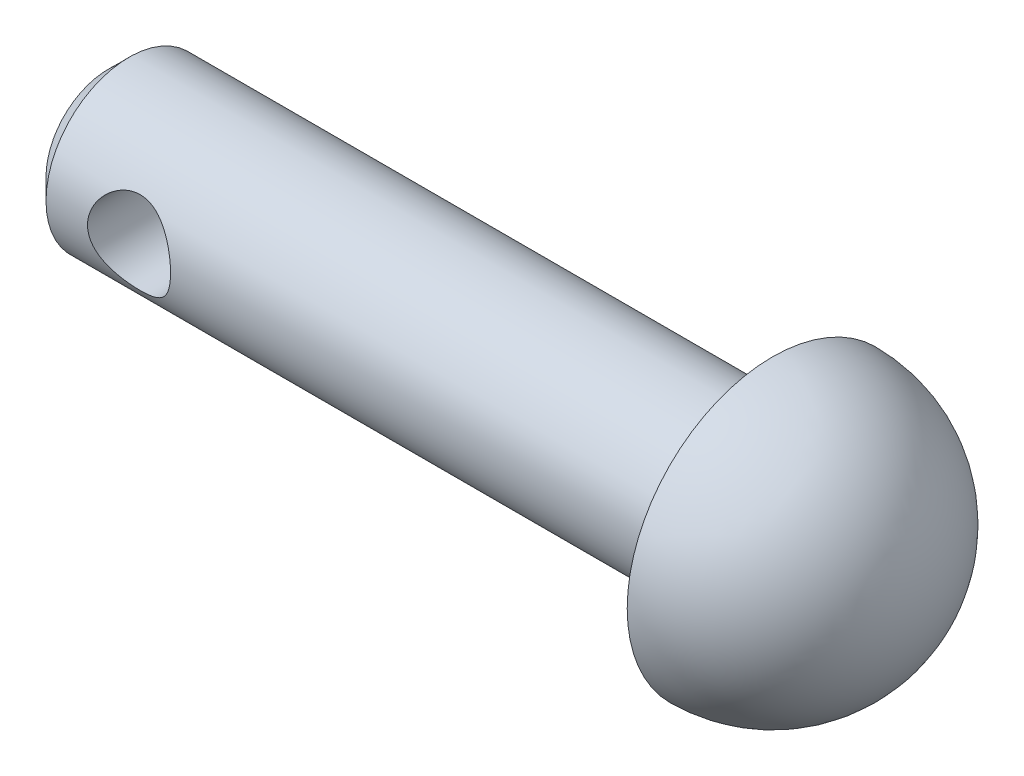
ISO-10303-21;
HEADER;
FILE_DESCRIPTION(('STEP AP214'),'2;1');
FILE_NAME('part.step','',(''),(''),'','','');
FILE_SCHEMA(('AUTOMOTIVE_DESIGN { 1 0 10303 214 1 1 1 1 }'));
ENDSEC;
DATA;
#1=APPLICATION_CONTEXT('core data for automotive mechanical design processes');
#2=APPLICATION_PROTOCOL_DEFINITION('international standard','automotive_design',2000,#1);
#3=PRODUCT_CONTEXT('',#1,'mechanical');
#4=PRODUCT('Part','Part','',(#3));
#5=PRODUCT_RELATED_PRODUCT_CATEGORY('part','',(#4));
#6=PRODUCT_DEFINITION_FORMATION('','',#4);
#7=PRODUCT_DEFINITION_CONTEXT('part definition',#1,'design');
#8=PRODUCT_DEFINITION('design','',#6,#7);
#9=PRODUCT_DEFINITION_SHAPE('','',#8);
#10=(LENGTH_UNIT() NAMED_UNIT(*) SI_UNIT(.MILLI.,.METRE.));
#11=(NAMED_UNIT(*) PLANE_ANGLE_UNIT() SI_UNIT($,.RADIAN.));
#12=(NAMED_UNIT(*) SI_UNIT($,.STERADIAN.) SOLID_ANGLE_UNIT());
#13=UNCERTAINTY_MEASURE_WITH_UNIT(LENGTH_MEASURE(1.E-05),#10,'distance_accuracy_value','');
#14=(GEOMETRIC_REPRESENTATION_CONTEXT(3) GLOBAL_UNCERTAINTY_ASSIGNED_CONTEXT((#13)) GLOBAL_UNIT_ASSIGNED_CONTEXT((#10,
#11,#12)) REPRESENTATION_CONTEXT('',''));
#15=CARTESIAN_POINT('',(0.,0.,0.));
#16=DIRECTION('',(0.,0.,1.));
#17=DIRECTION('',(1.,0.,0.));
#18=AXIS2_PLACEMENT_3D('',#15,#16,#17);
#19=CARTESIAN_POINT('',(9.01040905770635,0.,0.));
#20=DIRECTION('',(-1.,0.,0.));
#21=DIRECTION('',(0.,-1.,0.));
#22=AXIS2_PLACEMENT_3D('',#19,#20,#21);
#23=SPHERICAL_SURFACE('',#22,3.5);
#24=CARTESIAN_POINT('',(9.01040905770635,0.,0.));
#25=DIRECTION('',(-1.,0.,0.));
#26=DIRECTION('',(0.,0.,1.));
#27=AXIS2_PLACEMENT_3D('',#24,#25,#26);
#28=CIRCLE('',#27,3.5);
#29=CARTESIAN_POINT('',(9.01040905770635,0.,3.5));
#30=VERTEX_POINT('',#29);
#31=EDGE_CURVE('E52',#30,#30,#28,.T.);
#32=ORIENTED_EDGE('',*,*,#31,.F.);
#33=EDGE_LOOP('',(#32));
#34=FACE_BOUND('',#33,.T.);
#35=ADVANCED_FACE('F33',(#34),#23,.T.);
#36=CARTESIAN_POINT('',(9.01040905770635,2.,0.));
#37=DIRECTION('',(-1.,0.,0.));
#38=DIRECTION('',(0.,0.,1.));
#39=AXIS2_PLACEMENT_3D('',#36,#37,#38);
#40=PLANE('',#39);
#41=ORIENTED_EDGE('',*,*,#31,.T.);
#42=EDGE_LOOP('',(#41));
#43=FACE_BOUND('',#42,.T.);
#44=CARTESIAN_POINT('',(9.01040905770635,0.,0.));
#45=DIRECTION('',(-1.,0.,0.));
#46=DIRECTION('',(0.,0.,1.));
#47=AXIS2_PLACEMENT_3D('',#44,#45,#46);
#48=CIRCLE('',#47,2.);
#49=CARTESIAN_POINT('',(9.01040905770635,0.,2.));
#50=VERTEX_POINT('',#49);
#51=EDGE_CURVE('E87',#50,#50,#48,.T.);
#52=ORIENTED_EDGE('',*,*,#51,.F.);
#53=EDGE_LOOP('',(#52));
#54=FACE_BOUND('',#53,.T.);
#55=ADVANCED_FACE('F77',(#43,#54),#40,.T.);
#56=CARTESIAN_POINT('',(-10.0706720233747,0.,0.));
#57=DIRECTION('',(-1.,0.,0.));
#58=DIRECTION('',(0.,0.,1.));
#59=AXIS2_PLACEMENT_3D('',#56,#57,#58);
#60=CYLINDRICAL_SURFACE('',#59,2.);
#61=CARTESIAN_POINT('',(-3.48959094229365,0.,2.));
#62=CARTESIAN_POINT('',(-3.48959424461315,0.0525719629529865,1.99999713404151));
#63=CARTESIAN_POINT('',(-3.49376101541532,0.105206599698033,1.99790491019518));
#64=CARTESIAN_POINT('',(-3.51024382263456,0.208920235268425,1.98974156037396));
#65=CARTESIAN_POINT('',(-3.5225753352913,0.259996086713504,1.98366287828984));
#66=CARTESIAN_POINT('',(-3.55478475091044,0.358933544880574,1.96816279403312));
#67=CARTESIAN_POINT('',(-3.57463332654166,0.40680680293918,1.9587543917752));
#68=CARTESIAN_POINT('',(-3.62116156365859,0.498472616806565,1.93745776515779));
#69=CARTESIAN_POINT('',(-3.6478406865425,0.54226549399005,1.9255697363353));
#70=CARTESIAN_POINT('',(-3.70910819177895,0.627507817761919,1.89956258258057));
#71=CARTESIAN_POINT('',(-3.74407742153329,0.668655211122112,1.88535199127536));
#72=CARTESIAN_POINT('',(-3.82011242154068,0.744779444866977,1.85659970246744));
#73=CARTESIAN_POINT('',(-3.86118279406609,0.779751583106767,1.84205776209035));
#74=CARTESIAN_POINT('',(-3.95207429181703,0.845252000450279,1.81298951197347));
#75=CARTESIAN_POINT('',(-4.00232704063956,0.875225335551637,1.79855186970132));
#76=CARTESIAN_POINT('',(-4.10795827827986,0.926168226890696,1.77285978772321));
#77=CARTESIAN_POINT('',(-4.1633330710164,0.947144214966334,1.7616030760699));
#78=CARTESIAN_POINT('',(-4.27425604771557,0.978132442188589,1.74457867037808));
#79=CARTESIAN_POINT('',(-4.32959539436104,0.988725857080442,1.73852271583714));
#80=CARTESIAN_POINT('',(-4.44156978007313,1.00042699330885,1.73181889948528));
#81=CARTESIAN_POINT('',(-4.4982034831648,1.00154408837307,1.73116569343288));
#82=CARTESIAN_POINT('',(-4.60387696660902,0.994687287172295,1.73510930257248));
#83=CARTESIAN_POINT('',(-4.6530149735167,0.987784559536821,1.73908763662014));
#84=CARTESIAN_POINT('',(-4.74931285166669,0.966939849056932,1.7507622873385));
#85=CARTESIAN_POINT('',(-4.79647208759896,0.952995623897652,1.75845978831776));
#86=CARTESIAN_POINT('',(-4.88882007485931,0.918209780386004,1.77687476412741));
#87=CARTESIAN_POINT('',(-4.93393734107944,0.897215067115995,1.78765840663998));
#88=CARTESIAN_POINT('',(-5.02022523488366,0.849041687668002,1.81103404281404));
#89=CARTESIAN_POINT('',(-5.06139407789374,0.821860243812467,1.82362684780191));
#90=CARTESIAN_POINT('',(-5.14411219503687,0.758066054912788,1.85113157903286));
#91=CARTESIAN_POINT('',(-5.18504781586981,0.720694458369282,1.86613510236746));
#92=CARTESIAN_POINT('',(-5.26032636088455,0.639555578741374,1.89547623300407));
#93=CARTESIAN_POINT('',(-5.29466613432753,0.595785256574285,1.90981351958801));
#94=CARTESIAN_POINT('',(-5.35727660332337,0.500516505831848,1.93701987282964));
#95=CARTESIAN_POINT('',(-5.38519141473939,0.448753591599409,1.94978984162007));
#96=CARTESIAN_POINT('',(-5.43168797133666,0.340466215488797,1.97157881121242));
#97=CARTESIAN_POINT('',(-5.45027712730881,0.283945576265276,1.98060078943553));
#98=CARTESIAN_POINT('',(-5.47606634601032,0.172766491660701,1.99324333741436));
#99=CARTESIAN_POINT('',(-5.48408217804043,0.118341530548324,1.99724938301312));
#100=CARTESIAN_POINT('',(-5.49105567342814,0.00877959994935342,2.00073013459102));
#101=CARTESIAN_POINT('',(-5.49001762793313,-0.0463570198699015,2.00020698721312));
#102=CARTESIAN_POINT('',(-5.47938425387489,-0.151232971985994,1.99491192253441));
#103=CARTESIAN_POINT('',(-5.47045840956362,-0.201059408049954,1.9904724568819));
#104=CARTESIAN_POINT('',(-5.44535287039856,-0.298406892301917,1.97822171314819));
#105=CARTESIAN_POINT('',(-5.42917237584029,-0.345927685690997,1.97041006334332));
#106=CARTESIAN_POINT('',(-5.38959247586048,-0.438888608449666,1.95184251413669));
#107=CARTESIAN_POINT('',(-5.36599989217684,-0.484230397006154,1.94100881769939));
#108=CARTESIAN_POINT('',(-5.3124834066476,-0.570461361698921,1.91743974317109));
#109=CARTESIAN_POINT('',(-5.28255680770022,-0.611348629775282,1.90470355565785));
#110=CARTESIAN_POINT('',(-5.21383051696077,-0.691767689290653,1.87708221337464));
#111=CARTESIAN_POINT('',(-5.17444807384008,-0.730772077824639,1.86210884848441));
#112=CARTESIAN_POINT('',(-5.08966579102434,-0.801856321113239,1.83262391603874));
#113=CARTESIAN_POINT('',(-5.04426182347727,-0.833931385690841,1.81811267381526));
#114=CARTESIAN_POINT('',(-4.94594728809334,-0.891707914497697,1.79051192226068));
#115=CARTESIAN_POINT('',(-4.89277967608505,-0.917025495878638,1.77752529663472));
#116=CARTESIAN_POINT('',(-4.78208087460112,-0.958082826013804,1.75574072368126));
#117=CARTESIAN_POINT('',(-4.72455541579246,-0.97383491588757,1.74693738240618));
#118=CARTESIAN_POINT('',(-4.6126807194322,-0.993861687449679,1.73561501008667));
#119=CARTESIAN_POINT('',(-4.55855668886461,-0.999092996400865,1.73257383460491));
#120=CARTESIAN_POINT('',(-4.45014387512292,-1.00068915438079,1.73165354646175));
#121=CARTESIAN_POINT('',(-4.39585517355421,-0.997057846624399,1.73377219627553));
#122=CARTESIAN_POINT('',(-4.29410744076163,-0.981926125592263,1.74237862050025));
#123=CARTESIAN_POINT('',(-4.24649047214925,-0.9712083143428,1.74843094482394));
#124=CARTESIAN_POINT('',(-4.15378282286894,-0.943175358224646,1.76371016187917));
#125=CARTESIAN_POINT('',(-4.10869296020168,-0.925858091159811,1.77293807569676));
#126=CARTESIAN_POINT('',(-4.01896609130704,-0.883815745300683,1.79428530364528));
#127=CARTESIAN_POINT('',(-3.97456304046395,-0.858671137816458,1.80655722396191));
#128=CARTESIAN_POINT('',(-3.89031640611306,-0.802150971636634,1.8323533163459));
#129=CARTESIAN_POINT('',(-3.85047521177516,-0.770772171238648,1.84587813794522));
#130=CARTESIAN_POINT('',(-3.77144895993603,-0.698203326664641,1.87462323159313));
#131=CARTESIAN_POINT('',(-3.73293183993173,-0.656284423010172,1.88984983311469));
#132=CARTESIAN_POINT('',(-3.66332795887002,-0.56615480622028,1.91877752255088));
#133=CARTESIAN_POINT('',(-3.63224520286736,-0.517940723256785,1.9324777860804));
#134=CARTESIAN_POINT('',(-3.57835457953144,-0.415931596819947,1.95698009585103));
#135=CARTESIAN_POINT('',(-3.55560677288221,-0.362099503934615,1.96776096562909));
#136=CARTESIAN_POINT('',(-3.5197827743747,-0.250742101294192,1.98501341363465));
#137=CARTESIAN_POINT('',(-3.50667909546407,-0.193227799623166,1.99149723372932));
#138=CARTESIAN_POINT('',(-3.4956935312178,-0.112601946483384,1.99695461909663));
#139=CARTESIAN_POINT('',(-3.49340830143003,-0.0901618794394988,1.99809365339202));
#140=CARTESIAN_POINT('',(-3.49035627677684,-0.0451517318071577,1.99961696977865));
#141=CARTESIAN_POINT('',(-3.48958952382245,-0.0225816476473814,2.00000123103763));
#142=CARTESIAN_POINT('',(-3.48959094229365,0.,2.));
#143=B_SPLINE_CURVE_WITH_KNOTS('',3,(#61,#62,#63,#64,#65,#66,#67,#68,#69,#70,#71,#72,#73,#74,
#75,#76,#77,#78,#79,#80,#81,#82,#83,#84,#85,#86,#87,#88,#89,#90,#91,#92,#93,#94,#95,#96,#97,#98,
#99,#100,#101,#102,#103,#104,#105,#106,#107,#108,#109,#110,#111,#112,#113,#114,#115,#116,#117,
#118,#119,#120,#121,#122,#123,#124,#125,#126,#127,#128,#129,#130,#131,#132,#133,#134,#135,#136,
#137,#138,#139,#140,#141,#142),.UNSPECIFIED.,.T.,.F.,(4,2,2,2,2,2,2,2,2,2,2,2,2,2,2,2,2,2,2,2,2,
2,2,2,2,2,2,2,2,2,2,2,2,2,2,2,2,2,2,2,4),(0.,0.157624257420293,0.315548149709198,
0.472862155492298,0.630163760581568,0.796981758718089,0.963926237654035,1.14381726430753,
1.32357947898281,1.4925801214023,1.66141357329021,1.81005712409321,1.95874803925679,
2.11090240168487,2.26312521260222,2.43464941333879,2.60625534598686,2.78583022214441,
2.9652621691228,3.12983290471346,3.29432564511476,3.44606906506122,3.59782921630932,
3.75392856027899,3.91009450748339,4.08159610644419,4.25321588615432,4.43314682159674,
4.61284511940778,4.77529307498374,4.93767059860005,5.08457930244183,5.23153528783678,
5.38836456775614,5.54527561138958,5.72125242752498,5.89732383376573,6.07464013662925,
6.2514490862493,6.31915280137698,6.38685838514847),.UNSPECIFIED.);
#144=CARTESIAN_POINT('',(-3.48959094229365,0.,2.));
#145=VERTEX_POINT('',#144);
#146=EDGE_CURVE('E38',#145,#145,#143,.T.);
#147=ORIENTED_EDGE('',*,*,#146,.F.);
#148=EDGE_LOOP('',(#147));
#149=FACE_BOUND('',#148,.T.);
#150=CARTESIAN_POINT('',(-3.48959094229365,0.,-2.));
#151=CARTESIAN_POINT('',(-3.48959424461315,-0.0525719629529865,-1.99999713404151));
#152=CARTESIAN_POINT('',(-3.49376101541532,-0.105206599698033,-1.99790491019518));
#153=CARTESIAN_POINT('',(-3.51024382263456,-0.208920235268425,-1.98974156037396));
#154=CARTESIAN_POINT('',(-3.5225753352913,-0.259996086713504,-1.98366287828984));
#155=CARTESIAN_POINT('',(-3.55478475091044,-0.358933544880574,-1.96816279403312));
#156=CARTESIAN_POINT('',(-3.57463332654166,-0.40680680293918,-1.9587543917752));
#157=CARTESIAN_POINT('',(-3.62116156365859,-0.498472616806565,-1.93745776515779));
#158=CARTESIAN_POINT('',(-3.6478406865425,-0.54226549399005,-1.9255697363353));
#159=CARTESIAN_POINT('',(-3.70910819177895,-0.627507817761919,-1.89956258258057));
#160=CARTESIAN_POINT('',(-3.74407742153329,-0.668655211122112,-1.88535199127536));
#161=CARTESIAN_POINT('',(-3.82011242154068,-0.744779444866977,-1.85659970246744));
#162=CARTESIAN_POINT('',(-3.86118279406609,-0.779751583106767,-1.84205776209035));
#163=CARTESIAN_POINT('',(-3.95207429181703,-0.845252000450279,-1.81298951197347));
#164=CARTESIAN_POINT('',(-4.00232704063956,-0.875225335551637,-1.79855186970132));
#165=CARTESIAN_POINT('',(-4.10795827827986,-0.926168226890696,-1.77285978772321));
#166=CARTESIAN_POINT('',(-4.1633330710164,-0.947144214966334,-1.7616030760699));
#167=CARTESIAN_POINT('',(-4.27425604771557,-0.978132442188589,-1.74457867037808));
#168=CARTESIAN_POINT('',(-4.32959539436104,-0.988725857080442,-1.73852271583714));
#169=CARTESIAN_POINT('',(-4.44156978007313,-1.00042699330885,-1.73181889948528));
#170=CARTESIAN_POINT('',(-4.4982034831648,-1.00154408837307,-1.73116569343288));
#171=CARTESIAN_POINT('',(-4.60387696660902,-0.994687287172295,-1.73510930257248));
#172=CARTESIAN_POINT('',(-4.6530149735167,-0.987784559536821,-1.73908763662014));
#173=CARTESIAN_POINT('',(-4.74931285166669,-0.966939849056932,-1.7507622873385));
#174=CARTESIAN_POINT('',(-4.79647208759896,-0.952995623897652,-1.75845978831776));
#175=CARTESIAN_POINT('',(-4.88882007485931,-0.918209780386004,-1.77687476412741));
#176=CARTESIAN_POINT('',(-4.93393734107944,-0.897215067115995,-1.78765840663998));
#177=CARTESIAN_POINT('',(-5.02022523488366,-0.849041687668002,-1.81103404281404));
#178=CARTESIAN_POINT('',(-5.06139407789374,-0.821860243812467,-1.82362684780191));
#179=CARTESIAN_POINT('',(-5.14411219503687,-0.758066054912788,-1.85113157903286));
#180=CARTESIAN_POINT('',(-5.18504781586981,-0.720694458369282,-1.86613510236746));
#181=CARTESIAN_POINT('',(-5.26032636088455,-0.639555578741374,-1.89547623300407));
#182=CARTESIAN_POINT('',(-5.29466613432753,-0.595785256574285,-1.90981351958801));
#183=CARTESIAN_POINT('',(-5.35727660332337,-0.500516505831848,-1.93701987282964));
#184=CARTESIAN_POINT('',(-5.38519141473939,-0.448753591599409,-1.94978984162007));
#185=CARTESIAN_POINT('',(-5.43168797133666,-0.340466215488797,-1.97157881121242));
#186=CARTESIAN_POINT('',(-5.45027712730881,-0.283945576265276,-1.98060078943553));
#187=CARTESIAN_POINT('',(-5.47606634601032,-0.172766491660701,-1.99324333741436));
#188=CARTESIAN_POINT('',(-5.48408217804043,-0.118341530548324,-1.99724938301312));
#189=CARTESIAN_POINT('',(-5.49105567342814,-0.00877959994935342,-2.00073013459102));
#190=CARTESIAN_POINT('',(-5.49001762793313,0.0463570198699015,-2.00020698721312));
#191=CARTESIAN_POINT('',(-5.47938425387489,0.151232971985994,-1.99491192253441));
#192=CARTESIAN_POINT('',(-5.47045840956362,0.201059408049954,-1.9904724568819));
#193=CARTESIAN_POINT('',(-5.44535287039856,0.298406892301917,-1.97822171314819));
#194=CARTESIAN_POINT('',(-5.42917237584029,0.345927685690997,-1.97041006334332));
#195=CARTESIAN_POINT('',(-5.38959247586048,0.438888608449666,-1.95184251413669));
#196=CARTESIAN_POINT('',(-5.36599989217684,0.484230397006154,-1.94100881769939));
#197=CARTESIAN_POINT('',(-5.3124834066476,0.570461361698921,-1.91743974317109));
#198=CARTESIAN_POINT('',(-5.28255680770022,0.611348629775282,-1.90470355565785));
#199=CARTESIAN_POINT('',(-5.21383051696077,0.691767689290653,-1.87708221337464));
#200=CARTESIAN_POINT('',(-5.17444807384008,0.730772077824639,-1.86210884848441));
#201=CARTESIAN_POINT('',(-5.08966579102434,0.801856321113239,-1.83262391603874));
#202=CARTESIAN_POINT('',(-5.04426182347727,0.833931385690841,-1.81811267381526));
#203=CARTESIAN_POINT('',(-4.94594728809334,0.891707914497697,-1.79051192226068));
#204=CARTESIAN_POINT('',(-4.89277967608505,0.917025495878638,-1.77752529663472));
#205=CARTESIAN_POINT('',(-4.78208087460112,0.958082826013804,-1.75574072368126));
#206=CARTESIAN_POINT('',(-4.72455541579246,0.97383491588757,-1.74693738240618));
#207=CARTESIAN_POINT('',(-4.6126807194322,0.993861687449679,-1.73561501008667));
#208=CARTESIAN_POINT('',(-4.55855668886461,0.999092996400865,-1.73257383460491));
#209=CARTESIAN_POINT('',(-4.45014387512292,1.00068915438079,-1.73165354646175));
#210=CARTESIAN_POINT('',(-4.39585517355421,0.997057846624399,-1.73377219627553));
#211=CARTESIAN_POINT('',(-4.29410744076163,0.981926125592263,-1.74237862050025));
#212=CARTESIAN_POINT('',(-4.24649047214925,0.9712083143428,-1.74843094482394));
#213=CARTESIAN_POINT('',(-4.15378282286894,0.943175358224646,-1.76371016187917));
#214=CARTESIAN_POINT('',(-4.10869296020168,0.925858091159811,-1.77293807569676));
#215=CARTESIAN_POINT('',(-4.01896609130704,0.883815745300683,-1.79428530364528));
#216=CARTESIAN_POINT('',(-3.97456304046395,0.858671137816458,-1.80655722396191));
#217=CARTESIAN_POINT('',(-3.89031640611306,0.802150971636634,-1.8323533163459));
#218=CARTESIAN_POINT('',(-3.85047521177516,0.770772171238648,-1.84587813794522));
#219=CARTESIAN_POINT('',(-3.77144895993603,0.698203326664641,-1.87462323159313));
#220=CARTESIAN_POINT('',(-3.73293183993173,0.656284423010172,-1.88984983311469));
#221=CARTESIAN_POINT('',(-3.66332795887002,0.56615480622028,-1.91877752255088));
#222=CARTESIAN_POINT('',(-3.63224520286736,0.517940723256785,-1.9324777860804));
#223=CARTESIAN_POINT('',(-3.57835457953144,0.415931596819947,-1.95698009585103));
#224=CARTESIAN_POINT('',(-3.55560677288221,0.362099503934615,-1.96776096562909));
#225=CARTESIAN_POINT('',(-3.5197827743747,0.250742101294192,-1.98501341363465));
#226=CARTESIAN_POINT('',(-3.50667909546407,0.193227799623166,-1.99149723372932));
#227=CARTESIAN_POINT('',(-3.4956935312178,0.112601946483384,-1.99695461909663));
#228=CARTESIAN_POINT('',(-3.49340830143003,0.0901618794394988,-1.99809365339202));
#229=CARTESIAN_POINT('',(-3.49035627677684,0.0451517318071577,-1.99961696977865));
#230=CARTESIAN_POINT('',(-3.48958952382245,0.0225816476473814,-2.00000123103763));
#231=CARTESIAN_POINT('',(-3.48959094229365,0.,-2.));
#232=B_SPLINE_CURVE_WITH_KNOTS('',3,(#150,#151,#152,#153,#154,#155,#156,#157,#158,#159,#160,
#161,#162,#163,#164,#165,#166,#167,#168,#169,#170,#171,#172,#173,#174,#175,#176,#177,#178,#179,
#180,#181,#182,#183,#184,#185,#186,#187,#188,#189,#190,#191,#192,#193,#194,#195,#196,#197,#198,
#199,#200,#201,#202,#203,#204,#205,#206,#207,#208,#209,#210,#211,#212,#213,#214,#215,#216,#217,
#218,#219,#220,#221,#222,#223,#224,#225,#226,#227,#228,#229,#230,#231),.UNSPECIFIED.,.T.,.F.,(4,
2,2,2,2,2,2,2,2,2,2,2,2,2,2,2,2,2,2,2,2,2,2,2,2,2,2,2,2,2,2,2,2,2,2,2,2,2,2,2,4),(0.,
0.157624257420293,0.315548149709198,0.472862155492298,0.630163760581568,0.796981758718089,
0.963926237654035,1.14381726430753,1.32357947898281,1.4925801214023,1.66141357329021,
1.81005712409321,1.95874803925679,2.11090240168487,2.26312521260222,2.43464941333879,
2.60625534598686,2.78583022214441,2.9652621691228,3.12983290471346,3.29432564511476,
3.44606906506122,3.59782921630932,3.75392856027899,3.91009450748339,4.08159610644419,
4.25321588615432,4.43314682159674,4.61284511940778,4.77529307498374,4.93767059860005,
5.08457930244183,5.23153528783678,5.38836456775614,5.54527561138958,5.72125242752498,
5.89732383376573,6.07464013662925,6.2514490862493,6.31915280137698,6.38685838514847),.UNSPECIFIED.);
#233=CARTESIAN_POINT('',(-3.48959094229365,0.,-2.));
#234=VERTEX_POINT('',#233);
#235=EDGE_CURVE('E55',#234,#234,#232,.T.);
#236=ORIENTED_EDGE('',*,*,#235,.F.);
#237=EDGE_LOOP('',(#236));
#238=FACE_BOUND('',#237,.T.);
#239=CARTESIAN_POINT('',(-6.48959094229365,0.,0.));
#240=DIRECTION('',(-1.,0.,0.));
#241=DIRECTION('',(0.,0.,1.));
#242=AXIS2_PLACEMENT_3D('',#239,#240,#241);
#243=CIRCLE('',#242,2.);
#244=CARTESIAN_POINT('',(-6.48959094229365,0.,2.));
#245=VERTEX_POINT('',#244);
#246=EDGE_CURVE('E10',#245,#245,#243,.F.);
#247=ORIENTED_EDGE('',*,*,#246,.T.);
#248=EDGE_LOOP('',(#247));
#249=FACE_BOUND('',#248,.T.);
#250=ORIENTED_EDGE('',*,*,#51,.T.);
#251=EDGE_LOOP('',(#250));
#252=FACE_BOUND('',#251,.T.);
#253=ADVANCED_FACE('F60',(#149,#238,#249,#252),#60,.T.);
#254=CARTESIAN_POINT('',(-6.98959094229365,0.,0.));
#255=DIRECTION('',(-1.,0.,0.));
#256=DIRECTION('',(0.,0.,1.));
#257=AXIS2_PLACEMENT_3D('',#254,#255,#256);
#258=PLANE('',#257);
#259=CARTESIAN_POINT('',(-6.98959094229365,0.,0.));
#260=DIRECTION('',(-1.,0.,0.));
#261=DIRECTION('',(0.,0.,1.));
#262=AXIS2_PLACEMENT_3D('',#259,#260,#261);
#263=CIRCLE('',#262,1.5);
#264=CARTESIAN_POINT('',(-6.98959094229365,0.,1.5));
#265=VERTEX_POINT('',#264);
#266=EDGE_CURVE('E47',#265,#265,#263,.T.);
#267=ORIENTED_EDGE('',*,*,#266,.T.);
#268=EDGE_LOOP('',(#267));
#269=FACE_BOUND('',#268,.T.);
#270=ADVANCED_FACE('F68',(#269),#258,.T.);
#271=CARTESIAN_POINT('',(-6.98959094229365,0.,0.));
#272=DIRECTION('',(1.,0.,0.));
#273=DIRECTION('',(0.,0.,-1.));
#274=AXIS2_PLACEMENT_3D('',#271,#272,#273);
#275=CONICAL_SURFACE('',#274,1.5,0.785398163397448);
#276=ORIENTED_EDGE('',*,*,#246,.F.);
#277=EDGE_LOOP('',(#276));
#278=FACE_BOUND('',#277,.T.);
#279=ORIENTED_EDGE('',*,*,#266,.F.);
#280=EDGE_LOOP('',(#279));
#281=FACE_BOUND('',#280,.T.);
#282=ADVANCED_FACE('F36',(#278,#281),#275,.T.);
#283=CARTESIAN_POINT('',(-4.48959094229365,0.,-3.5));
#284=DIRECTION('',(0.,0.,1.));
#285=DIRECTION('',(1.,0.,0.));
#286=AXIS2_PLACEMENT_3D('',#283,#284,#285);
#287=CYLINDRICAL_SURFACE('',#286,1.);
#288=ORIENTED_EDGE('',*,*,#146,.T.);
#289=EDGE_LOOP('',(#288));
#290=FACE_BOUND('',#289,.T.);
#291=ORIENTED_EDGE('',*,*,#235,.T.);
#292=EDGE_LOOP('',(#291));
#293=FACE_BOUND('',#292,.T.);
#294=ADVANCED_FACE('F64',(#290,#293),#287,.F.);
#295=CLOSED_SHELL('',(#35,#55,#253,#270,#282,#294));
#296=MANIFOLD_SOLID_BREP('B2',#295);
#297=ADVANCED_BREP_SHAPE_REPRESENTATION('',(#18,#296),#14);
#298=SHAPE_DEFINITION_REPRESENTATION(#9,#297);
ENDSEC;
END-ISO-10303-21;
